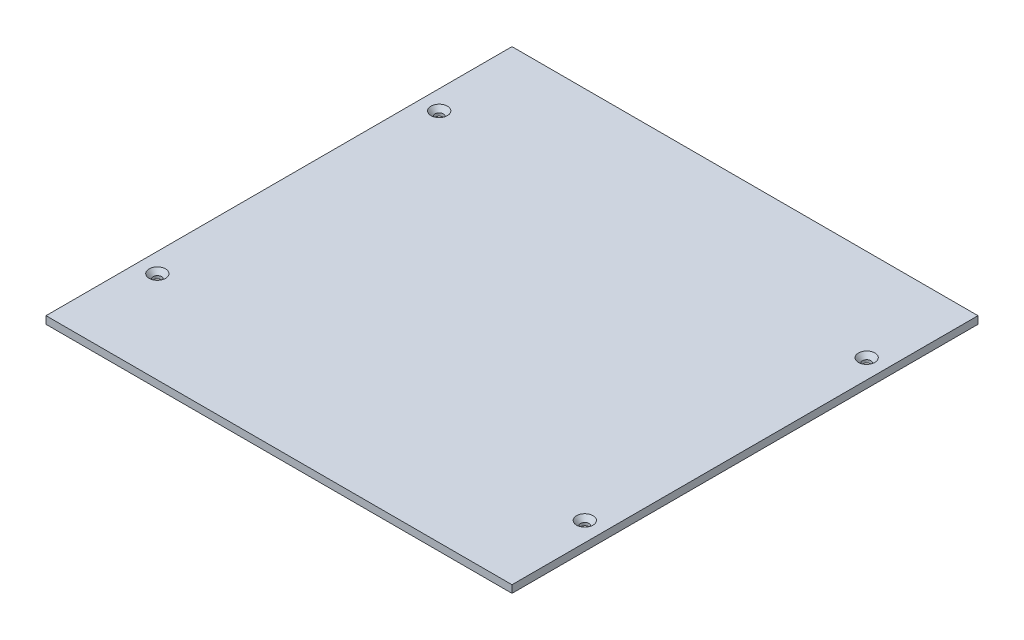
ISO-10303-21;
HEADER;
FILE_DESCRIPTION(('STEP AP214'),'2;1');
FILE_NAME('part.step','',(''),(''),'','','');
FILE_SCHEMA(('AUTOMOTIVE_DESIGN { 1 0 10303 214 1 1 1 1 }'));
ENDSEC;
DATA;
#1=APPLICATION_CONTEXT('core data for automotive mechanical design processes');
#2=APPLICATION_PROTOCOL_DEFINITION('international standard','automotive_design',2000,#1);
#3=PRODUCT_CONTEXT('',#1,'mechanical');
#4=PRODUCT('Part','Part','',(#3));
#5=PRODUCT_RELATED_PRODUCT_CATEGORY('part','',(#4));
#6=PRODUCT_DEFINITION_FORMATION('','',#4);
#7=PRODUCT_DEFINITION_CONTEXT('part definition',#1,'design');
#8=PRODUCT_DEFINITION('design','',#6,#7);
#9=PRODUCT_DEFINITION_SHAPE('','',#8);
#10=(LENGTH_UNIT() NAMED_UNIT(*) SI_UNIT(.MILLI.,.METRE.));
#11=(NAMED_UNIT(*) PLANE_ANGLE_UNIT() SI_UNIT($,.RADIAN.));
#12=(NAMED_UNIT(*) SI_UNIT($,.STERADIAN.) SOLID_ANGLE_UNIT());
#13=UNCERTAINTY_MEASURE_WITH_UNIT(LENGTH_MEASURE(1.E-05),#10,'distance_accuracy_value','');
#14=(GEOMETRIC_REPRESENTATION_CONTEXT(3) GLOBAL_UNCERTAINTY_ASSIGNED_CONTEXT((#13)) GLOBAL_UNIT_ASSIGNED_CONTEXT((#10,
#11,#12)) REPRESENTATION_CONTEXT('',''));
#15=CARTESIAN_POINT('',(0.,0.,0.));
#16=DIRECTION('',(0.,0.,1.));
#17=DIRECTION('',(1.,0.,0.));
#18=AXIS2_PLACEMENT_3D('',#15,#16,#17);
#19=CARTESIAN_POINT('',(0.,1.6002,0.));
#20=DIRECTION('',(1.,0.,0.));
#21=DIRECTION('',(0.,0.,-1.));
#22=AXIS2_PLACEMENT_3D('',#19,#20,#21);
#23=PLANE('',#22);
#24=DIRECTION('',(0.,0.,1.));
#25=VECTOR('',#24,1.);
#26=CARTESIAN_POINT('',(0.,0.,0.));
#27=LINE('',#26,#25);
#28=CARTESIAN_POINT('',(0.,0.,-99.2004));
#29=VERTEX_POINT('',#28);
#30=CARTESIAN_POINT('',(0.,0.,0.));
#31=VERTEX_POINT('',#30);
#32=EDGE_CURVE('E103',#29,#31,#27,.T.);
#33=ORIENTED_EDGE('',*,*,#32,.T.);
#34=DIRECTION('',(0.,-1.,0.));
#35=VECTOR('',#34,1.);
#36=CARTESIAN_POINT('',(0.,1.6002,0.));
#37=LINE('',#36,#35);
#38=CARTESIAN_POINT('',(0.,1.6002,0.));
#39=VERTEX_POINT('',#38);
#40=EDGE_CURVE('E11',#39,#31,#37,.T.);
#41=ORIENTED_EDGE('',*,*,#40,.F.);
#42=DIRECTION('',(0.,0.,1.));
#43=VECTOR('',#42,1.);
#44=CARTESIAN_POINT('',(0.,1.6002,0.));
#45=LINE('',#44,#43);
#46=CARTESIAN_POINT('',(0.,1.6002,-99.2004));
#47=VERTEX_POINT('',#46);
#48=EDGE_CURVE('E91',#47,#39,#45,.T.);
#49=ORIENTED_EDGE('',*,*,#48,.F.);
#50=DIRECTION('',(0.,-1.,0.));
#51=VECTOR('',#50,1.);
#52=CARTESIAN_POINT('',(0.,1.6002,-99.2004));
#53=LINE('',#52,#51);
#54=EDGE_CURVE('E99',#47,#29,#53,.T.);
#55=ORIENTED_EDGE('',*,*,#54,.T.);
#56=EDGE_LOOP('',(#33,#41,#49,#55));
#57=FACE_BOUND('',#56,.T.);
#58=ADVANCED_FACE('F40',(#57),#23,.F.);
#59=CARTESIAN_POINT('',(0.,1.6002,0.));
#60=DIRECTION('',(0.,0.,-1.));
#61=DIRECTION('',(-1.,0.,0.));
#62=AXIS2_PLACEMENT_3D('',#59,#60,#61);
#63=PLANE('',#62);
#64=DIRECTION('',(1.,0.,0.));
#65=VECTOR('',#64,1.);
#66=CARTESIAN_POINT('',(0.,0.,0.));
#67=LINE('',#66,#65);
#68=CARTESIAN_POINT('',(99.2004,0.,0.));
#69=VERTEX_POINT('',#68);
#70=EDGE_CURVE('E95',#31,#69,#67,.T.);
#71=ORIENTED_EDGE('',*,*,#70,.T.);
#72=DIRECTION('',(0.,-1.,0.));
#73=VECTOR('',#72,1.);
#74=CARTESIAN_POINT('',(99.2004,1.6002,0.));
#75=LINE('',#74,#73);
#76=CARTESIAN_POINT('',(99.2004,1.6002,0.));
#77=VERTEX_POINT('',#76);
#78=EDGE_CURVE('E48',#77,#69,#75,.T.);
#79=ORIENTED_EDGE('',*,*,#78,.F.);
#80=DIRECTION('',(1.,0.,0.));
#81=VECTOR('',#80,1.);
#82=CARTESIAN_POINT('',(0.,1.6002,0.));
#83=LINE('',#82,#81);
#84=EDGE_CURVE('E86',#39,#77,#83,.T.);
#85=ORIENTED_EDGE('',*,*,#84,.F.);
#86=ORIENTED_EDGE('',*,*,#40,.T.);
#87=EDGE_LOOP('',(#71,#79,#85,#86));
#88=FACE_BOUND('',#87,.T.);
#89=ADVANCED_FACE('F94',(#88),#63,.F.);
#90=CARTESIAN_POINT('',(99.2004,1.6002,0.));
#91=DIRECTION('',(-1.,0.,0.));
#92=DIRECTION('',(0.,0.,1.));
#93=AXIS2_PLACEMENT_3D('',#90,#91,#92);
#94=PLANE('',#93);
#95=DIRECTION('',(0.,0.,-1.));
#96=VECTOR('',#95,1.);
#97=CARTESIAN_POINT('',(99.2004,0.,0.));
#98=LINE('',#97,#96);
#99=CARTESIAN_POINT('',(99.2004,0.,-99.2004));
#100=VERTEX_POINT('',#99);
#101=EDGE_CURVE('E73',#69,#100,#98,.T.);
#102=ORIENTED_EDGE('',*,*,#101,.T.);
#103=DIRECTION('',(0.,-1.,0.));
#104=VECTOR('',#103,1.);
#105=CARTESIAN_POINT('',(99.2004,1.6002,-99.2004));
#106=LINE('',#105,#104);
#107=CARTESIAN_POINT('',(99.2004,1.6002,-99.2004));
#108=VERTEX_POINT('',#107);
#109=EDGE_CURVE('E96',#108,#100,#106,.T.);
#110=ORIENTED_EDGE('',*,*,#109,.F.);
#111=DIRECTION('',(0.,0.,-1.));
#112=VECTOR('',#111,1.);
#113=CARTESIAN_POINT('',(99.2004,1.6002,0.));
#114=LINE('',#113,#112);
#115=EDGE_CURVE('E89',#77,#108,#114,.T.);
#116=ORIENTED_EDGE('',*,*,#115,.F.);
#117=ORIENTED_EDGE('',*,*,#78,.T.);
#118=EDGE_LOOP('',(#102,#110,#116,#117));
#119=FACE_BOUND('',#118,.T.);
#120=ADVANCED_FACE('F97',(#119),#94,.F.);
#121=CARTESIAN_POINT('',(0.,1.6002,-99.2004));
#122=DIRECTION('',(0.,0.,1.));
#123=DIRECTION('',(1.,0.,0.));
#124=AXIS2_PLACEMENT_3D('',#121,#122,#123);
#125=PLANE('',#124);
#126=DIRECTION('',(-1.,0.,0.));
#127=VECTOR('',#126,1.);
#128=CARTESIAN_POINT('',(0.,0.,-99.2004));
#129=LINE('',#128,#127);
#130=EDGE_CURVE('E79',#100,#29,#129,.T.);
#131=ORIENTED_EDGE('',*,*,#130,.T.);
#132=ORIENTED_EDGE('',*,*,#54,.F.);
#133=DIRECTION('',(-1.,0.,0.));
#134=VECTOR('',#133,1.);
#135=CARTESIAN_POINT('',(0.,1.6002,-99.2004));
#136=LINE('',#135,#134);
#137=EDGE_CURVE('E56',#108,#47,#136,.T.);
#138=ORIENTED_EDGE('',*,*,#137,.F.);
#139=ORIENTED_EDGE('',*,*,#109,.T.);
#140=EDGE_LOOP('',(#131,#132,#138,#139));
#141=FACE_BOUND('',#140,.T.);
#142=ADVANCED_FACE('F111',(#141),#125,.F.);
#143=CARTESIAN_POINT('',(0.,1.6002,0.));
#144=DIRECTION('',(0.,-1.,0.));
#145=DIRECTION('',(0.,0.,-1.));
#146=AXIS2_PLACEMENT_3D('',#143,#144,#145);
#147=PLANE('',#146);
#148=CARTESIAN_POINT('',(4.10019999999998,1.6002,-79.6002));
#149=DIRECTION('',(0.,1.,0.));
#150=DIRECTION('',(0.,0.,1.));
#151=AXIS2_PLACEMENT_3D('',#148,#149,#150);
#152=CIRCLE('',#151,1.7526);
#153=CARTESIAN_POINT('',(4.10019999999998,1.6002,-77.8476));
#154=VERTEX_POINT('',#153);
#155=EDGE_CURVE('E149',#154,#154,#152,.T.);
#156=ORIENTED_EDGE('',*,*,#155,.F.);
#157=EDGE_LOOP('',(#156));
#158=FACE_BOUND('',#157,.T.);
#159=CARTESIAN_POINT('',(4.10019999999999,1.6002,-19.6002));
#160=DIRECTION('',(0.,1.,0.));
#161=DIRECTION('',(0.,0.,1.));
#162=AXIS2_PLACEMENT_3D('',#159,#160,#161);
#163=CIRCLE('',#162,1.7526);
#164=CARTESIAN_POINT('',(4.10019999999999,1.6002,-17.8476));
#165=VERTEX_POINT('',#164);
#166=EDGE_CURVE('E140',#165,#165,#163,.T.);
#167=ORIENTED_EDGE('',*,*,#166,.F.);
#168=EDGE_LOOP('',(#167));
#169=FACE_BOUND('',#168,.T.);
#170=CARTESIAN_POINT('',(95.1002,1.6002,-19.6002));
#171=DIRECTION('',(0.,1.,0.));
#172=DIRECTION('',(0.,0.,1.));
#173=AXIS2_PLACEMENT_3D('',#170,#171,#172);
#174=CIRCLE('',#173,1.75260000000001);
#175=CARTESIAN_POINT('',(95.1002,1.6002,-17.8476));
#176=VERTEX_POINT('',#175);
#177=EDGE_CURVE('E131',#176,#176,#174,.T.);
#178=ORIENTED_EDGE('',*,*,#177,.F.);
#179=EDGE_LOOP('',(#178));
#180=FACE_BOUND('',#179,.T.);
#181=CARTESIAN_POINT('',(95.1002,1.6002,-79.6002));
#182=DIRECTION('',(0.,1.,0.));
#183=DIRECTION('',(0.,0.,1.));
#184=AXIS2_PLACEMENT_3D('',#181,#182,#183);
#185=CIRCLE('',#184,1.75259999999999);
#186=CARTESIAN_POINT('',(95.1002,1.6002,-77.8476));
#187=VERTEX_POINT('',#186);
#188=EDGE_CURVE('E122',#187,#187,#185,.T.);
#189=ORIENTED_EDGE('',*,*,#188,.F.);
#190=EDGE_LOOP('',(#189));
#191=FACE_BOUND('',#190,.T.);
#192=ORIENTED_EDGE('',*,*,#48,.T.);
#193=ORIENTED_EDGE('',*,*,#84,.T.);
#194=ORIENTED_EDGE('',*,*,#115,.T.);
#195=ORIENTED_EDGE('',*,*,#137,.T.);
#196=EDGE_LOOP('',(#192,#193,#194,#195));
#197=FACE_BOUND('',#196,.T.);
#198=ADVANCED_FACE('F87',(#158,#169,#180,#191,#197),#147,.F.);
#199=CARTESIAN_POINT('',(0.,0.,0.));
#200=DIRECTION('',(0.,-1.,0.));
#201=DIRECTION('',(0.,0.,-1.));
#202=AXIS2_PLACEMENT_3D('',#199,#200,#201);
#203=PLANE('',#202);
#204=CARTESIAN_POINT('',(4.10019999999998,0.,-79.6002));
#205=DIRECTION('',(0.,1.,0.));
#206=DIRECTION('',(0.,0.,1.));
#207=AXIS2_PLACEMENT_3D('',#204,#205,#206);
#208=CIRCLE('',#207,0.889);
#209=CARTESIAN_POINT('',(4.10019999999998,0.,-78.7112));
#210=VERTEX_POINT('',#209);
#211=EDGE_CURVE('E143',#210,#210,#208,.T.);
#212=ORIENTED_EDGE('',*,*,#211,.T.);
#213=EDGE_LOOP('',(#212));
#214=FACE_BOUND('',#213,.T.);
#215=CARTESIAN_POINT('',(4.10019999999999,0.,-19.6002));
#216=DIRECTION('',(0.,1.,0.));
#217=DIRECTION('',(0.,0.,1.));
#218=AXIS2_PLACEMENT_3D('',#215,#216,#217);
#219=CIRCLE('',#218,0.888999999999999);
#220=CARTESIAN_POINT('',(4.10019999999999,0.,-18.7112));
#221=VERTEX_POINT('',#220);
#222=EDGE_CURVE('E134',#221,#221,#219,.T.);
#223=ORIENTED_EDGE('',*,*,#222,.T.);
#224=EDGE_LOOP('',(#223));
#225=FACE_BOUND('',#224,.T.);
#226=CARTESIAN_POINT('',(95.1002,0.,-19.6002));
#227=DIRECTION('',(0.,1.,0.));
#228=DIRECTION('',(0.,0.,1.));
#229=AXIS2_PLACEMENT_3D('',#226,#227,#228);
#230=CIRCLE('',#229,0.889000000000001);
#231=CARTESIAN_POINT('',(95.1002,0.,-18.7112));
#232=VERTEX_POINT('',#231);
#233=EDGE_CURVE('E125',#232,#232,#230,.T.);
#234=ORIENTED_EDGE('',*,*,#233,.T.);
#235=EDGE_LOOP('',(#234));
#236=FACE_BOUND('',#235,.T.);
#237=CARTESIAN_POINT('',(95.1002,0.,-79.6002));
#238=DIRECTION('',(0.,1.,0.));
#239=DIRECTION('',(0.,0.,1.));
#240=AXIS2_PLACEMENT_3D('',#237,#238,#239);
#241=CIRCLE('',#240,0.889000000000001);
#242=CARTESIAN_POINT('',(95.1002,0.,-78.7112));
#243=VERTEX_POINT('',#242);
#244=EDGE_CURVE('E106',#243,#243,#241,.T.);
#245=ORIENTED_EDGE('',*,*,#244,.T.);
#246=EDGE_LOOP('',(#245));
#247=FACE_BOUND('',#246,.T.);
#248=ORIENTED_EDGE('',*,*,#32,.F.);
#249=ORIENTED_EDGE('',*,*,#130,.F.);
#250=ORIENTED_EDGE('',*,*,#101,.F.);
#251=ORIENTED_EDGE('',*,*,#70,.F.);
#252=EDGE_LOOP('',(#248,#249,#250,#251));
#253=FACE_BOUND('',#252,.T.);
#254=ADVANCED_FACE('F114',(#214,#225,#236,#247,#253),#203,.T.);
#255=CARTESIAN_POINT('',(95.1002,1.6002,-79.6002));
#256=DIRECTION('',(0.,1.,0.));
#257=DIRECTION('',(0.,0.,1.));
#258=AXIS2_PLACEMENT_3D('',#255,#256,#257);
#259=CYLINDRICAL_SURFACE('',#258,0.889000000000001);
#260=ORIENTED_EDGE('',*,*,#244,.F.);
#261=EDGE_LOOP('',(#260));
#262=FACE_BOUND('',#261,.T.);
#263=CARTESIAN_POINT('',(95.1002,0.606741843523937,-79.6002));
#264=DIRECTION('',(0.,1.,0.));
#265=DIRECTION('',(0.,0.,1.));
#266=AXIS2_PLACEMENT_3D('',#263,#264,#265);
#267=CIRCLE('',#266,0.889000000000001);
#268=CARTESIAN_POINT('',(95.1002,0.606741843523937,-78.7112));
#269=VERTEX_POINT('',#268);
#270=EDGE_CURVE('E119',#269,#269,#267,.T.);
#271=ORIENTED_EDGE('',*,*,#270,.T.);
#272=EDGE_LOOP('',(#271));
#273=FACE_BOUND('',#272,.T.);
#274=ADVANCED_FACE('F167',(#262,#273),#259,.F.);
#275=CARTESIAN_POINT('',(95.1002,1.6002,-79.6002));
#276=DIRECTION('',(0.,1.,0.));
#277=DIRECTION('',(0.,0.,1.));
#278=AXIS2_PLACEMENT_3D('',#275,#276,#277);
#279=CONICAL_SURFACE('',#278,1.75259999999999,0.715584993317671);
#280=ORIENTED_EDGE('',*,*,#270,.F.);
#281=EDGE_LOOP('',(#280));
#282=FACE_BOUND('',#281,.T.);
#283=ORIENTED_EDGE('',*,*,#188,.T.);
#284=EDGE_LOOP('',(#283));
#285=FACE_BOUND('',#284,.T.);
#286=ADVANCED_FACE('F164',(#282,#285),#279,.F.);
#287=CARTESIAN_POINT('',(95.1002,1.6002,-19.6002));
#288=DIRECTION('',(0.,1.,0.));
#289=DIRECTION('',(0.,0.,1.));
#290=AXIS2_PLACEMENT_3D('',#287,#288,#289);
#291=CYLINDRICAL_SURFACE('',#290,0.889000000000001);
#292=ORIENTED_EDGE('',*,*,#233,.F.);
#293=EDGE_LOOP('',(#292));
#294=FACE_BOUND('',#293,.T.);
#295=CARTESIAN_POINT('',(95.1002,0.606741843523937,-19.6002));
#296=DIRECTION('',(0.,1.,0.));
#297=DIRECTION('',(0.,0.,1.));
#298=AXIS2_PLACEMENT_3D('',#295,#296,#297);
#299=CIRCLE('',#298,0.889000000000001);
#300=CARTESIAN_POINT('',(95.1002,0.606741843523937,-18.7112));
#301=VERTEX_POINT('',#300);
#302=EDGE_CURVE('E128',#301,#301,#299,.T.);
#303=ORIENTED_EDGE('',*,*,#302,.T.);
#304=EDGE_LOOP('',(#303));
#305=FACE_BOUND('',#304,.T.);
#306=ADVANCED_FACE('F166',(#294,#305),#291,.F.);
#307=CARTESIAN_POINT('',(95.1002,1.6002,-19.6002));
#308=DIRECTION('',(0.,1.,0.));
#309=DIRECTION('',(0.,0.,1.));
#310=AXIS2_PLACEMENT_3D('',#307,#308,#309);
#311=CONICAL_SURFACE('',#310,1.75260000000001,0.715584993317679);
#312=ORIENTED_EDGE('',*,*,#302,.F.);
#313=EDGE_LOOP('',(#312));
#314=FACE_BOUND('',#313,.T.);
#315=ORIENTED_EDGE('',*,*,#177,.T.);
#316=EDGE_LOOP('',(#315));
#317=FACE_BOUND('',#316,.T.);
#318=ADVANCED_FACE('F174',(#314,#317),#311,.F.);
#319=CARTESIAN_POINT('',(4.10019999999999,1.6002,-19.6002));
#320=DIRECTION('',(0.,1.,0.));
#321=DIRECTION('',(0.,0.,1.));
#322=AXIS2_PLACEMENT_3D('',#319,#320,#321);
#323=CYLINDRICAL_SURFACE('',#322,0.889);
#324=ORIENTED_EDGE('',*,*,#222,.F.);
#325=EDGE_LOOP('',(#324));
#326=FACE_BOUND('',#325,.T.);
#327=CARTESIAN_POINT('',(4.10019999999999,0.606741843523937,-19.6002));
#328=DIRECTION('',(0.,1.,0.));
#329=DIRECTION('',(0.,0.,1.));
#330=AXIS2_PLACEMENT_3D('',#327,#328,#329);
#331=CIRCLE('',#330,0.889);
#332=CARTESIAN_POINT('',(4.10019999999999,0.606741843523937,-18.7112));
#333=VERTEX_POINT('',#332);
#334=EDGE_CURVE('E137',#333,#333,#331,.T.);
#335=ORIENTED_EDGE('',*,*,#334,.T.);
#336=EDGE_LOOP('',(#335));
#337=FACE_BOUND('',#336,.T.);
#338=ADVANCED_FACE('F210',(#326,#337),#323,.F.);
#339=CARTESIAN_POINT('',(4.10019999999999,1.6002,-19.6002));
#340=DIRECTION('',(0.,1.,0.));
#341=DIRECTION('',(0.,0.,1.));
#342=AXIS2_PLACEMENT_3D('',#339,#340,#341);
#343=CONICAL_SURFACE('',#342,1.7526,0.715584993317676);
#344=ORIENTED_EDGE('',*,*,#334,.F.);
#345=EDGE_LOOP('',(#344));
#346=FACE_BOUND('',#345,.T.);
#347=ORIENTED_EDGE('',*,*,#166,.T.);
#348=EDGE_LOOP('',(#347));
#349=FACE_BOUND('',#348,.T.);
#350=ADVANCED_FACE('F215',(#346,#349),#343,.F.);
#351=CARTESIAN_POINT('',(4.10019999999998,1.6002,-79.6002));
#352=DIRECTION('',(0.,1.,0.));
#353=DIRECTION('',(0.,0.,1.));
#354=AXIS2_PLACEMENT_3D('',#351,#352,#353);
#355=CYLINDRICAL_SURFACE('',#354,0.889);
#356=ORIENTED_EDGE('',*,*,#211,.F.);
#357=EDGE_LOOP('',(#356));
#358=FACE_BOUND('',#357,.T.);
#359=CARTESIAN_POINT('',(4.10019999999998,0.606741843523937,-79.6002));
#360=DIRECTION('',(0.,1.,0.));
#361=DIRECTION('',(0.,0.,1.));
#362=AXIS2_PLACEMENT_3D('',#359,#360,#361);
#363=CIRCLE('',#362,0.889);
#364=CARTESIAN_POINT('',(4.10019999999998,0.606741843523937,-78.7112));
#365=VERTEX_POINT('',#364);
#366=EDGE_CURVE('E146',#365,#365,#363,.T.);
#367=ORIENTED_EDGE('',*,*,#366,.T.);
#368=EDGE_LOOP('',(#367));
#369=FACE_BOUND('',#368,.T.);
#370=ADVANCED_FACE('F221',(#358,#369),#355,.F.);
#371=CARTESIAN_POINT('',(4.10019999999998,1.6002,-79.6002));
#372=DIRECTION('',(0.,1.,0.));
#373=DIRECTION('',(0.,0.,1.));
#374=AXIS2_PLACEMENT_3D('',#371,#372,#373);
#375=CONICAL_SURFACE('',#374,1.7526,0.715584993317676);
#376=ORIENTED_EDGE('',*,*,#366,.F.);
#377=EDGE_LOOP('',(#376));
#378=FACE_BOUND('',#377,.T.);
#379=ORIENTED_EDGE('',*,*,#155,.T.);
#380=EDGE_LOOP('',(#379));
#381=FACE_BOUND('',#380,.T.);
#382=ADVANCED_FACE('F153',(#378,#381),#375,.F.);
#383=CLOSED_SHELL('',(#58,#89,#120,#142,#198,#254,#274,#286,#306,#318,#338,#350,#370,#382));
#384=MANIFOLD_SOLID_BREP('B2',#383);
#385=ADVANCED_BREP_SHAPE_REPRESENTATION('',(#18,#384),#14);
#386=SHAPE_DEFINITION_REPRESENTATION(#9,#385);
ENDSEC;
END-ISO-10303-21;
